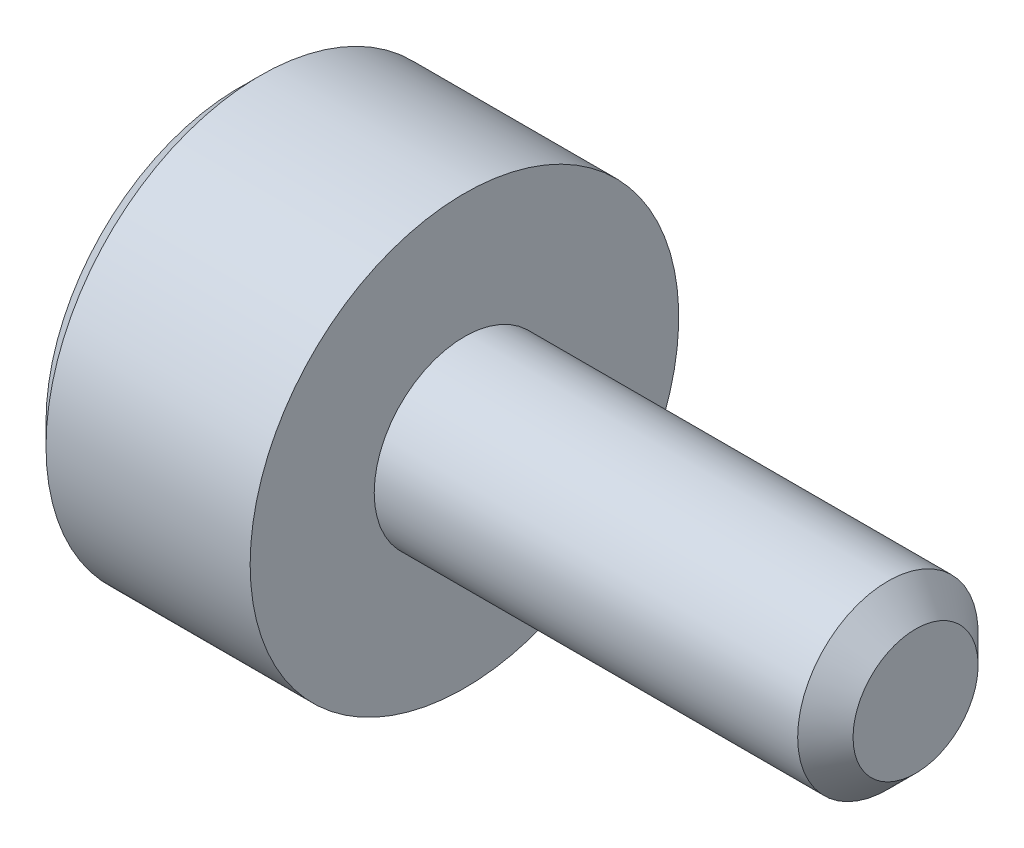
ISO-10303-21;
HEADER;
FILE_DESCRIPTION(('STEP AP214'),'2;1');
FILE_NAME('part.step','',(''),(''),'','','');
FILE_SCHEMA(('AUTOMOTIVE_DESIGN { 1 0 10303 214 1 1 1 1 }'));
ENDSEC;
DATA;
#1=APPLICATION_CONTEXT('core data for automotive mechanical design processes');
#2=APPLICATION_PROTOCOL_DEFINITION('international standard','automotive_design',2000,#1);
#3=PRODUCT_CONTEXT('',#1,'mechanical');
#4=PRODUCT('Part','Part','',(#3));
#5=PRODUCT_RELATED_PRODUCT_CATEGORY('part','',(#4));
#6=PRODUCT_DEFINITION_FORMATION('','',#4);
#7=PRODUCT_DEFINITION_CONTEXT('part definition',#1,'design');
#8=PRODUCT_DEFINITION('design','',#6,#7);
#9=PRODUCT_DEFINITION_SHAPE('','',#8);
#10=(LENGTH_UNIT() NAMED_UNIT(*) SI_UNIT(.MILLI.,.METRE.));
#11=(NAMED_UNIT(*) PLANE_ANGLE_UNIT() SI_UNIT($,.RADIAN.));
#12=(NAMED_UNIT(*) SI_UNIT($,.STERADIAN.) SOLID_ANGLE_UNIT());
#13=UNCERTAINTY_MEASURE_WITH_UNIT(LENGTH_MEASURE(1.E-05),#10,'distance_accuracy_value','');
#14=(GEOMETRIC_REPRESENTATION_CONTEXT(3) GLOBAL_UNCERTAINTY_ASSIGNED_CONTEXT((#13)) GLOBAL_UNIT_ASSIGNED_CONTEXT((#10,
#11,#12)) REPRESENTATION_CONTEXT('',''));
#15=CARTESIAN_POINT('',(0.,0.,0.));
#16=DIRECTION('',(0.,0.,1.));
#17=DIRECTION('',(1.,0.,0.));
#18=AXIS2_PLACEMENT_3D('',#15,#16,#17);
#19=CARTESIAN_POINT('',(-2.,0.,0.));
#20=DIRECTION('',(1.,0.,0.));
#21=DIRECTION('',(0.,0.,-1.));
#22=AXIS2_PLACEMENT_3D('',#19,#20,#21);
#23=PLANE('',#22);
#24=CARTESIAN_POINT('',(-2.,0.,0.));
#25=DIRECTION('',(-1.,0.,0.));
#26=DIRECTION('',(0.,0.,1.));
#27=AXIS2_PLACEMENT_3D('',#24,#25,#26);
#28=CIRCLE('',#27,1.71);
#29=CARTESIAN_POINT('',(-2.,0.,1.71));
#30=VERTEX_POINT('',#29);
#31=EDGE_CURVE('E11',#30,#30,#28,.T.);
#32=ORIENTED_EDGE('',*,*,#31,.T.);
#33=EDGE_LOOP('',(#32));
#34=FACE_BOUND('',#33,.T.);
#35=DIRECTION('',(0.,-1.,0.));
#36=VECTOR('',#35,1.);
#37=CARTESIAN_POINT('',(-2.,0.43301270189222,0.75));
#38=LINE('',#37,#36);
#39=CARTESIAN_POINT('',(-2.,0.43301270189222,0.75));
#40=VERTEX_POINT('',#39);
#41=CARTESIAN_POINT('',(-2.,-0.43301270189222,0.75));
#42=VERTEX_POINT('',#41);
#43=EDGE_CURVE('E53',#40,#42,#38,.T.);
#44=ORIENTED_EDGE('',*,*,#43,.T.);
#45=DIRECTION('',(0.,-0.500000000000001,-0.866025403784438));
#46=VECTOR('',#45,1.);
#47=CARTESIAN_POINT('',(-2.,-0.43301270189222,0.75));
#48=LINE('',#47,#46);
#49=CARTESIAN_POINT('',(-2.,-0.86602540378444,0.));
#50=VERTEX_POINT('',#49);
#51=EDGE_CURVE('E124',#42,#50,#48,.T.);
#52=ORIENTED_EDGE('',*,*,#51,.T.);
#53=DIRECTION('',(0.,0.500000000000001,-0.866025403784438));
#54=VECTOR('',#53,1.);
#55=CARTESIAN_POINT('',(-2.,-0.86602540378444,0.));
#56=LINE('',#55,#54);
#57=CARTESIAN_POINT('',(-2.,-0.43301270189222,-0.75));
#58=VERTEX_POINT('',#57);
#59=EDGE_CURVE('E127',#50,#58,#56,.T.);
#60=ORIENTED_EDGE('',*,*,#59,.T.);
#61=DIRECTION('',(0.,1.,0.));
#62=VECTOR('',#61,1.);
#63=CARTESIAN_POINT('',(-2.,-0.43301270189222,-0.75));
#64=LINE('',#63,#62);
#65=CARTESIAN_POINT('',(-2.,0.43301270189222,-0.75));
#66=VERTEX_POINT('',#65);
#67=EDGE_CURVE('E130',#58,#66,#64,.T.);
#68=ORIENTED_EDGE('',*,*,#67,.T.);
#69=DIRECTION('',(0.,0.500000000000001,0.866025403784438));
#70=VECTOR('',#69,1.);
#71=CARTESIAN_POINT('',(-2.,0.43301270189222,-0.75));
#72=LINE('',#71,#70);
#73=CARTESIAN_POINT('',(-2.,0.86602540378444,0.));
#74=VERTEX_POINT('',#73);
#75=EDGE_CURVE('E114',#66,#74,#72,.T.);
#76=ORIENTED_EDGE('',*,*,#75,.T.);
#77=DIRECTION('',(0.,-0.500000000000001,0.866025403784438));
#78=VECTOR('',#77,1.);
#79=CARTESIAN_POINT('',(-2.,0.86602540378444,0.));
#80=LINE('',#79,#78);
#81=EDGE_CURVE('E133',#74,#40,#80,.T.);
#82=ORIENTED_EDGE('',*,*,#81,.T.);
#83=EDGE_LOOP('',(#44,#52,#60,#68,#76,#82));
#84=FACE_BOUND('',#83,.T.);
#85=ADVANCED_FACE('F39',(#34,#84),#23,.F.);
#86=CARTESIAN_POINT('',(-1.81,0.,0.));
#87=DIRECTION('',(1.,0.,0.));
#88=DIRECTION('',(0.,0.,-1.));
#89=AXIS2_PLACEMENT_3D('',#86,#87,#88);
#90=CONICAL_SURFACE('',#89,1.9,0.785398163397448);
#91=ORIENTED_EDGE('',*,*,#31,.F.);
#92=EDGE_LOOP('',(#91));
#93=FACE_BOUND('',#92,.T.);
#94=CARTESIAN_POINT('',(-1.81,0.,0.));
#95=DIRECTION('',(-1.,0.,0.));
#96=DIRECTION('',(0.,0.,1.));
#97=AXIS2_PLACEMENT_3D('',#94,#95,#96);
#98=CIRCLE('',#97,1.9);
#99=CARTESIAN_POINT('',(-1.81,0.,1.9));
#100=VERTEX_POINT('',#99);
#101=EDGE_CURVE('E46',#100,#100,#98,.T.);
#102=ORIENTED_EDGE('',*,*,#101,.T.);
#103=EDGE_LOOP('',(#102));
#104=FACE_BOUND('',#103,.T.);
#105=ADVANCED_FACE('F158',(#93,#104),#90,.T.);
#106=CARTESIAN_POINT('',(4.,0.,0.));
#107=DIRECTION('',(-1.,0.,0.));
#108=DIRECTION('',(0.,0.,1.));
#109=AXIS2_PLACEMENT_3D('',#106,#107,#108);
#110=CYLINDRICAL_SURFACE('',#109,1.9);
#111=ORIENTED_EDGE('',*,*,#101,.F.);
#112=EDGE_LOOP('',(#111));
#113=FACE_BOUND('',#112,.T.);
#114=CARTESIAN_POINT('',(0.,0.,0.));
#115=DIRECTION('',(-1.,0.,0.));
#116=DIRECTION('',(0.,0.,1.));
#117=AXIS2_PLACEMENT_3D('',#114,#115,#116);
#118=CIRCLE('',#117,1.9);
#119=CARTESIAN_POINT('',(0.,0.,1.9));
#120=VERTEX_POINT('',#119);
#121=EDGE_CURVE('E153',#120,#120,#118,.T.);
#122=ORIENTED_EDGE('',*,*,#121,.T.);
#123=EDGE_LOOP('',(#122));
#124=FACE_BOUND('',#123,.T.);
#125=ADVANCED_FACE('F160',(#113,#124),#110,.T.);
#126=CARTESIAN_POINT('',(0.,1.9,0.));
#127=DIRECTION('',(-1.,0.,0.));
#128=DIRECTION('',(0.,0.,1.));
#129=AXIS2_PLACEMENT_3D('',#126,#127,#128);
#130=PLANE('',#129);
#131=ORIENTED_EDGE('',*,*,#121,.F.);
#132=EDGE_LOOP('',(#131));
#133=FACE_BOUND('',#132,.T.);
#134=CARTESIAN_POINT('',(0.,0.,0.));
#135=DIRECTION('',(-1.,0.,0.));
#136=DIRECTION('',(0.,0.,1.));
#137=AXIS2_PLACEMENT_3D('',#134,#135,#136);
#138=CIRCLE('',#137,0.8);
#139=CARTESIAN_POINT('',(0.,0.,0.8));
#140=VERTEX_POINT('',#139);
#141=EDGE_CURVE('E150',#140,#140,#138,.T.);
#142=ORIENTED_EDGE('',*,*,#141,.T.);
#143=EDGE_LOOP('',(#142));
#144=FACE_BOUND('',#143,.T.);
#145=ADVANCED_FACE('F163',(#133,#144),#130,.F.);
#146=CARTESIAN_POINT('',(4.,0.,0.));
#147=DIRECTION('',(-1.,0.,0.));
#148=DIRECTION('',(0.,0.,1.));
#149=AXIS2_PLACEMENT_3D('',#146,#147,#148);
#150=CYLINDRICAL_SURFACE('',#149,0.8);
#151=ORIENTED_EDGE('',*,*,#141,.F.);
#152=EDGE_LOOP('',(#151));
#153=FACE_BOUND('',#152,.T.);
#154=CARTESIAN_POINT('',(3.7545,0.,0.));
#155=DIRECTION('',(-1.,0.,0.));
#156=DIRECTION('',(0.,0.,1.));
#157=AXIS2_PLACEMENT_3D('',#154,#155,#156);
#158=CIRCLE('',#157,0.8);
#159=CARTESIAN_POINT('',(3.7545,0.,0.8));
#160=VERTEX_POINT('',#159);
#161=EDGE_CURVE('E147',#160,#160,#158,.T.);
#162=ORIENTED_EDGE('',*,*,#161,.T.);
#163=EDGE_LOOP('',(#162));
#164=FACE_BOUND('',#163,.T.);
#165=ADVANCED_FACE('F169',(#153,#164),#150,.T.);
#166=CARTESIAN_POINT('',(4.,0.,0.));
#167=DIRECTION('',(-1.,0.,0.));
#168=DIRECTION('',(0.,0.,1.));
#169=AXIS2_PLACEMENT_3D('',#166,#167,#168);
#170=CONICAL_SURFACE('',#169,0.5545,0.785398163397448);
#171=ORIENTED_EDGE('',*,*,#161,.F.);
#172=EDGE_LOOP('',(#171));
#173=FACE_BOUND('',#172,.T.);
#174=CARTESIAN_POINT('',(4.,0.,0.));
#175=DIRECTION('',(-1.,0.,0.));
#176=DIRECTION('',(0.,0.,1.));
#177=AXIS2_PLACEMENT_3D('',#174,#175,#176);
#178=CIRCLE('',#177,0.5545);
#179=CARTESIAN_POINT('',(4.,0.,0.5545));
#180=VERTEX_POINT('',#179);
#181=EDGE_CURVE('E144',#180,#180,#178,.T.);
#182=ORIENTED_EDGE('',*,*,#181,.T.);
#183=EDGE_LOOP('',(#182));
#184=FACE_BOUND('',#183,.T.);
#185=ADVANCED_FACE('F175',(#173,#184),#170,.T.);
#186=CARTESIAN_POINT('',(4.,0.5545,0.));
#187=DIRECTION('',(-1.,0.,0.));
#188=DIRECTION('',(0.,0.,1.));
#189=AXIS2_PLACEMENT_3D('',#186,#187,#188);
#190=PLANE('',#189);
#191=ORIENTED_EDGE('',*,*,#181,.F.);
#192=EDGE_LOOP('',(#191));
#193=FACE_BOUND('',#192,.T.);
#194=ADVANCED_FACE('F181',(#193),#190,.F.);
#195=CARTESIAN_POINT('',(-1.2,0.43301270189222,0.75));
#196=DIRECTION('',(0.,0.,-1.));
#197=DIRECTION('',(-1.,0.,0.));
#198=AXIS2_PLACEMENT_3D('',#195,#196,#197);
#199=PLANE('',#198);
#200=ORIENTED_EDGE('',*,*,#43,.F.);
#201=DIRECTION('',(-1.,0.,0.));
#202=VECTOR('',#201,1.);
#203=CARTESIAN_POINT('',(-1.2,0.43301270189222,0.75));
#204=LINE('',#203,#202);
#205=CARTESIAN_POINT('',(-1.2,0.43301270189222,0.75));
#206=VERTEX_POINT('',#205);
#207=EDGE_CURVE('E119',#206,#40,#204,.T.);
#208=ORIENTED_EDGE('',*,*,#207,.F.);
#209=DIRECTION('',(0.,-1.,0.));
#210=VECTOR('',#209,1.);
#211=CARTESIAN_POINT('',(-1.2,0.43301270189222,0.75));
#212=LINE('',#211,#210);
#213=CARTESIAN_POINT('',(-1.2,-0.43301270189222,0.75));
#214=VERTEX_POINT('',#213);
#215=EDGE_CURVE('E136',#206,#214,#212,.T.);
#216=ORIENTED_EDGE('',*,*,#215,.T.);
#217=DIRECTION('',(-1.,0.,0.));
#218=VECTOR('',#217,1.);
#219=CARTESIAN_POINT('',(-1.2,-0.43301270189222,0.75));
#220=LINE('',#219,#218);
#221=EDGE_CURVE('E142',#214,#42,#220,.T.);
#222=ORIENTED_EDGE('',*,*,#221,.T.);
#223=EDGE_LOOP('',(#200,#208,#216,#222));
#224=FACE_BOUND('',#223,.T.);
#225=ADVANCED_FACE('F186',(#224),#199,.T.);
#226=CARTESIAN_POINT('',(-1.2,-0.43301270189222,0.75));
#227=DIRECTION('',(0.,0.866025403784438,-0.500000000000001));
#228=DIRECTION('',(0.,0.500000000000001,0.866025403784438));
#229=AXIS2_PLACEMENT_3D('',#226,#227,#228);
#230=PLANE('',#229);
#231=ORIENTED_EDGE('',*,*,#51,.F.);
#232=ORIENTED_EDGE('',*,*,#221,.F.);
#233=DIRECTION('',(0.,-0.500000000000001,-0.866025403784438));
#234=VECTOR('',#233,1.);
#235=CARTESIAN_POINT('',(-1.2,-0.43301270189222,0.75));
#236=LINE('',#235,#234);
#237=CARTESIAN_POINT('',(-1.2,-0.86602540378444,0.));
#238=VERTEX_POINT('',#237);
#239=EDGE_CURVE('E92',#214,#238,#236,.T.);
#240=ORIENTED_EDGE('',*,*,#239,.T.);
#241=DIRECTION('',(-1.,0.,0.));
#242=VECTOR('',#241,1.);
#243=CARTESIAN_POINT('',(-1.2,-0.86602540378444,0.));
#244=LINE('',#243,#242);
#245=EDGE_CURVE('E140',#238,#50,#244,.T.);
#246=ORIENTED_EDGE('',*,*,#245,.T.);
#247=EDGE_LOOP('',(#231,#232,#240,#246));
#248=FACE_BOUND('',#247,.T.);
#249=ADVANCED_FACE('F191',(#248),#230,.T.);
#250=CARTESIAN_POINT('',(-1.2,-0.86602540378444,0.));
#251=DIRECTION('',(0.,0.866025403784438,0.500000000000001));
#252=DIRECTION('',(0.,-0.500000000000001,0.866025403784438));
#253=AXIS2_PLACEMENT_3D('',#250,#251,#252);
#254=PLANE('',#253);
#255=ORIENTED_EDGE('',*,*,#59,.F.);
#256=ORIENTED_EDGE('',*,*,#245,.F.);
#257=DIRECTION('',(0.,0.500000000000001,-0.866025403784438));
#258=VECTOR('',#257,1.);
#259=CARTESIAN_POINT('',(-1.2,-0.86602540378444,0.));
#260=LINE('',#259,#258);
#261=CARTESIAN_POINT('',(-1.2,-0.43301270189222,-0.75));
#262=VERTEX_POINT('',#261);
#263=EDGE_CURVE('E110',#238,#262,#260,.T.);
#264=ORIENTED_EDGE('',*,*,#263,.T.);
#265=DIRECTION('',(-1.,0.,0.));
#266=VECTOR('',#265,1.);
#267=CARTESIAN_POINT('',(-1.2,-0.43301270189222,-0.75));
#268=LINE('',#267,#266);
#269=EDGE_CURVE('E107',#262,#58,#268,.T.);
#270=ORIENTED_EDGE('',*,*,#269,.T.);
#271=EDGE_LOOP('',(#255,#256,#264,#270));
#272=FACE_BOUND('',#271,.T.);
#273=ADVANCED_FACE('F208',(#272),#254,.T.);
#274=CARTESIAN_POINT('',(-1.2,-0.43301270189222,-0.75));
#275=DIRECTION('',(0.,0.,1.));
#276=DIRECTION('',(1.,0.,0.));
#277=AXIS2_PLACEMENT_3D('',#274,#275,#276);
#278=PLANE('',#277);
#279=ORIENTED_EDGE('',*,*,#67,.F.);
#280=ORIENTED_EDGE('',*,*,#269,.F.);
#281=DIRECTION('',(0.,1.,0.));
#282=VECTOR('',#281,1.);
#283=CARTESIAN_POINT('',(-1.2,-0.43301270189222,-0.75));
#284=LINE('',#283,#282);
#285=CARTESIAN_POINT('',(-1.2,0.43301270189222,-0.75));
#286=VERTEX_POINT('',#285);
#287=EDGE_CURVE('E102',#262,#286,#284,.T.);
#288=ORIENTED_EDGE('',*,*,#287,.T.);
#289=DIRECTION('',(-1.,0.,0.));
#290=VECTOR('',#289,1.);
#291=CARTESIAN_POINT('',(-1.2,0.43301270189222,-0.75));
#292=LINE('',#291,#290);
#293=EDGE_CURVE('E106',#286,#66,#292,.T.);
#294=ORIENTED_EDGE('',*,*,#293,.T.);
#295=EDGE_LOOP('',(#279,#280,#288,#294));
#296=FACE_BOUND('',#295,.T.);
#297=ADVANCED_FACE('F105',(#296),#278,.T.);
#298=CARTESIAN_POINT('',(-1.2,0.43301270189222,-0.75));
#299=DIRECTION('',(0.,-0.866025403784438,0.500000000000001));
#300=DIRECTION('',(0.,-0.500000000000001,-0.866025403784438));
#301=AXIS2_PLACEMENT_3D('',#298,#299,#300);
#302=PLANE('',#301);
#303=ORIENTED_EDGE('',*,*,#75,.F.);
#304=ORIENTED_EDGE('',*,*,#293,.F.);
#305=DIRECTION('',(0.,0.500000000000001,0.866025403784438));
#306=VECTOR('',#305,1.);
#307=CARTESIAN_POINT('',(-1.2,0.43301270189222,-0.75));
#308=LINE('',#307,#306);
#309=CARTESIAN_POINT('',(-1.2,0.86602540378444,0.));
#310=VERTEX_POINT('',#309);
#311=EDGE_CURVE('E109',#286,#310,#308,.T.);
#312=ORIENTED_EDGE('',*,*,#311,.T.);
#313=DIRECTION('',(-1.,0.,0.));
#314=VECTOR('',#313,1.);
#315=CARTESIAN_POINT('',(-1.2,0.86602540378444,0.));
#316=LINE('',#315,#314);
#317=EDGE_CURVE('E83',#310,#74,#316,.T.);
#318=ORIENTED_EDGE('',*,*,#317,.T.);
#319=EDGE_LOOP('',(#303,#304,#312,#318));
#320=FACE_BOUND('',#319,.T.);
#321=ADVANCED_FACE('F112',(#320),#302,.T.);
#322=CARTESIAN_POINT('',(-1.2,0.86602540378444,0.));
#323=DIRECTION('',(0.,-0.866025403784438,-0.500000000000001));
#324=DIRECTION('',(0.,0.500000000000001,-0.866025403784438));
#325=AXIS2_PLACEMENT_3D('',#322,#323,#324);
#326=PLANE('',#325);
#327=ORIENTED_EDGE('',*,*,#81,.F.);
#328=ORIENTED_EDGE('',*,*,#317,.F.);
#329=DIRECTION('',(0.,-0.500000000000001,0.866025403784438));
#330=VECTOR('',#329,1.);
#331=CARTESIAN_POINT('',(-1.2,0.86602540378444,0.));
#332=LINE('',#331,#330);
#333=EDGE_CURVE('E61',#310,#206,#332,.T.);
#334=ORIENTED_EDGE('',*,*,#333,.T.);
#335=ORIENTED_EDGE('',*,*,#207,.T.);
#336=EDGE_LOOP('',(#327,#328,#334,#335));
#337=FACE_BOUND('',#336,.T.);
#338=ADVANCED_FACE('F201',(#337),#326,.T.);
#339=CARTESIAN_POINT('',(-1.2,0.,0.));
#340=DIRECTION('',(1.,0.,0.));
#341=DIRECTION('',(0.,0.,-1.));
#342=AXIS2_PLACEMENT_3D('',#339,#340,#341);
#343=PLANE('',#342);
#344=ORIENTED_EDGE('',*,*,#215,.F.);
#345=ORIENTED_EDGE('',*,*,#333,.F.);
#346=ORIENTED_EDGE('',*,*,#311,.F.);
#347=ORIENTED_EDGE('',*,*,#287,.F.);
#348=ORIENTED_EDGE('',*,*,#263,.F.);
#349=ORIENTED_EDGE('',*,*,#239,.F.);
#350=EDGE_LOOP('',(#344,#345,#346,#347,#348,#349));
#351=FACE_BOUND('',#350,.T.);
#352=ADVANCED_FACE('F117',(#351),#343,.F.);
#353=CLOSED_SHELL('',(#85,#105,#125,#145,#165,#185,#194,#225,#249,#273,#297,#321,#338,#352));
#354=MANIFOLD_SOLID_BREP('B2',#353);
#355=ADVANCED_BREP_SHAPE_REPRESENTATION('',(#18,#354),#14);
#356=SHAPE_DEFINITION_REPRESENTATION(#9,#355);
ENDSEC;
END-ISO-10303-21;
